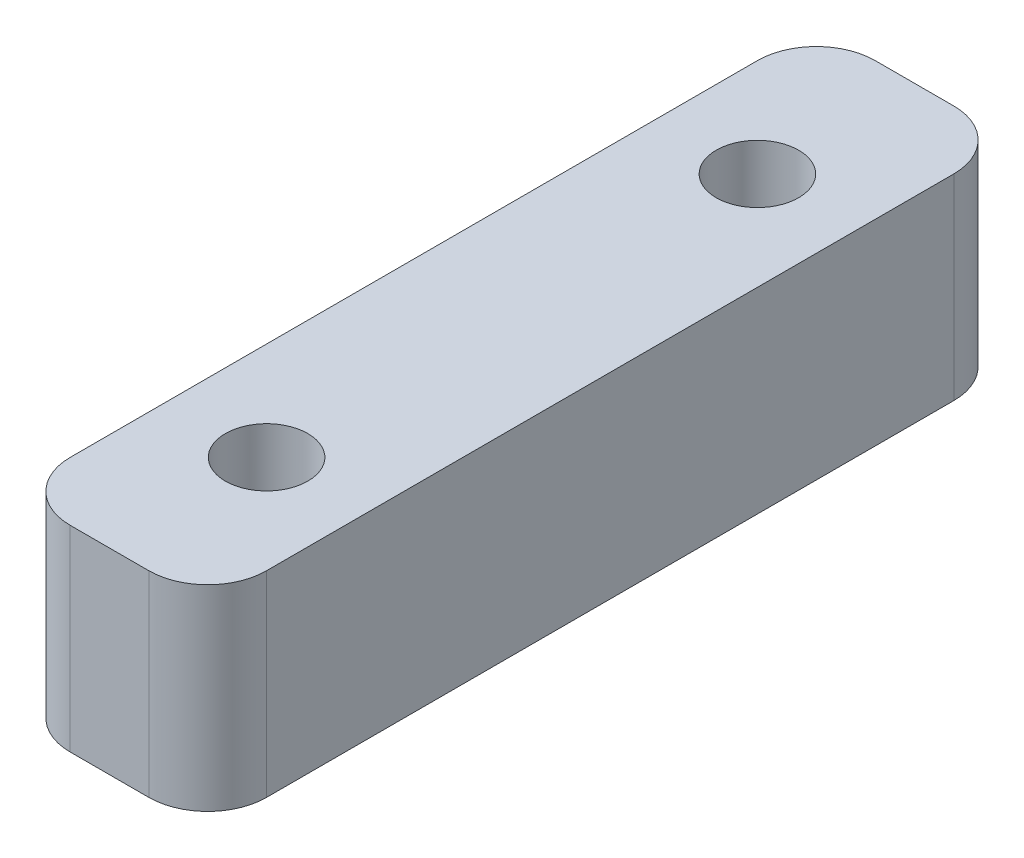
ISO-10303-21;
HEADER;
FILE_DESCRIPTION(('STEP AP214'),'2;1');
FILE_NAME('part.step','',(''),(''),'','','');
FILE_SCHEMA(('AUTOMOTIVE_DESIGN { 1 0 10303 214 1 1 1 1 }'));
ENDSEC;
DATA;
#1=APPLICATION_CONTEXT('core data for automotive mechanical design processes');
#2=APPLICATION_PROTOCOL_DEFINITION('international standard','automotive_design',2000,#1);
#3=PRODUCT_CONTEXT('',#1,'mechanical');
#4=PRODUCT('Part','Part','',(#3));
#5=PRODUCT_RELATED_PRODUCT_CATEGORY('part','',(#4));
#6=PRODUCT_DEFINITION_FORMATION('','',#4);
#7=PRODUCT_DEFINITION_CONTEXT('part definition',#1,'design');
#8=PRODUCT_DEFINITION('design','',#6,#7);
#9=PRODUCT_DEFINITION_SHAPE('','',#8);
#10=(LENGTH_UNIT() NAMED_UNIT(*) SI_UNIT(.MILLI.,.METRE.));
#11=(NAMED_UNIT(*) PLANE_ANGLE_UNIT() SI_UNIT($,.RADIAN.));
#12=(NAMED_UNIT(*) SI_UNIT($,.STERADIAN.) SOLID_ANGLE_UNIT());
#13=UNCERTAINTY_MEASURE_WITH_UNIT(LENGTH_MEASURE(1.E-05),#10,'distance_accuracy_value','');
#14=(GEOMETRIC_REPRESENTATION_CONTEXT(3) GLOBAL_UNCERTAINTY_ASSIGNED_CONTEXT((#13)) GLOBAL_UNIT_ASSIGNED_CONTEXT((#10,
#11,#12)) REPRESENTATION_CONTEXT('',''));
#15=CARTESIAN_POINT('',(0.,0.,0.));
#16=DIRECTION('',(0.,0.,1.));
#17=DIRECTION('',(1.,0.,0.));
#18=AXIS2_PLACEMENT_3D('',#15,#16,#17);
#19=CARTESIAN_POINT('',(0.,10.,0.));
#20=DIRECTION('',(0.,1.,0.));
#21=DIRECTION('',(0.,0.,1.));
#22=AXIS2_PLACEMENT_3D('',#19,#20,#21);
#23=PLANE('',#22);
#24=CARTESIAN_POINT('',(-47.5,10.,90.));
#25=DIRECTION('',(0.,1.,0.));
#26=DIRECTION('',(0.,0.,-1.));
#27=AXIS2_PLACEMENT_3D('',#24,#25,#26);
#28=CIRCLE('',#27,2.10000000000001);
#29=CARTESIAN_POINT('',(-47.5,10.,87.9));
#30=VERTEX_POINT('',#29);
#31=EDGE_CURVE('E157',#30,#30,#28,.T.);
#32=ORIENTED_EDGE('',*,*,#31,.F.);
#33=EDGE_LOOP('',(#32));
#34=FACE_BOUND('',#33,.T.);
#35=CARTESIAN_POINT('',(-47.5,10.,65.));
#36=DIRECTION('',(0.,1.,0.));
#37=DIRECTION('',(0.,0.,1.));
#38=AXIS2_PLACEMENT_3D('',#35,#36,#37);
#39=CIRCLE('',#38,2.1);
#40=CARTESIAN_POINT('',(-47.5,10.,67.1));
#41=VERTEX_POINT('',#40);
#42=EDGE_CURVE('E160',#41,#41,#39,.T.);
#43=ORIENTED_EDGE('',*,*,#42,.F.);
#44=EDGE_LOOP('',(#43));
#45=FACE_BOUND('',#44,.T.);
#46=DIRECTION('',(1.,0.,0.));
#47=VECTOR('',#46,1.);
#48=CARTESIAN_POINT('',(-67.5,10.,98.));
#49=LINE('',#48,#47);
#50=CARTESIAN_POINT('',(-49.5,10.,98.));
#51=VERTEX_POINT('',#50);
#52=CARTESIAN_POINT('',(-45.5,10.,98.));
#53=VERTEX_POINT('',#52);
#54=EDGE_CURVE('E103',#51,#53,#49,.T.);
#55=ORIENTED_EDGE('',*,*,#54,.T.);
#56=CARTESIAN_POINT('',(-45.5,10.,95.));
#57=DIRECTION('',(0.,1.,0.));
#58=DIRECTION('',(0.,0.,1.));
#59=AXIS2_PLACEMENT_3D('',#56,#57,#58);
#60=CIRCLE('',#59,3.);
#61=CARTESIAN_POINT('',(-42.5,10.,95.));
#62=VERTEX_POINT('',#61);
#63=EDGE_CURVE('E136',#53,#62,#60,.T.);
#64=ORIENTED_EDGE('',*,*,#63,.T.);
#65=DIRECTION('',(0.,0.,-1.));
#66=VECTOR('',#65,1.);
#67=CARTESIAN_POINT('',(-42.5,10.,97.9999999999999));
#68=LINE('',#67,#66);
#69=CARTESIAN_POINT('',(-42.5,10.,60.));
#70=VERTEX_POINT('',#69);
#71=EDGE_CURVE('E165',#62,#70,#68,.T.);
#72=ORIENTED_EDGE('',*,*,#71,.T.);
#73=CARTESIAN_POINT('',(-45.5,10.,60.));
#74=DIRECTION('',(0.,1.,0.));
#75=DIRECTION('',(0.,0.,1.));
#76=AXIS2_PLACEMENT_3D('',#73,#74,#75);
#77=CIRCLE('',#76,3.);
#78=CARTESIAN_POINT('',(-45.5,10.,57.));
#79=VERTEX_POINT('',#78);
#80=EDGE_CURVE('E134',#70,#79,#77,.T.);
#81=ORIENTED_EDGE('',*,*,#80,.T.);
#82=DIRECTION('',(-1.,0.,0.));
#83=VECTOR('',#82,1.);
#84=CARTESIAN_POINT('',(-67.5,10.,57.));
#85=LINE('',#84,#83);
#86=CARTESIAN_POINT('',(-49.5,10.,57.));
#87=VERTEX_POINT('',#86);
#88=EDGE_CURVE('E121',#79,#87,#85,.T.);
#89=ORIENTED_EDGE('',*,*,#88,.T.);
#90=CARTESIAN_POINT('',(-49.5,10.,60.));
#91=DIRECTION('',(0.,1.,0.));
#92=DIRECTION('',(0.,0.,1.));
#93=AXIS2_PLACEMENT_3D('',#90,#91,#92);
#94=CIRCLE('',#93,3.);
#95=CARTESIAN_POINT('',(-52.5,10.,60.));
#96=VERTEX_POINT('',#95);
#97=EDGE_CURVE('E110',#87,#96,#94,.T.);
#98=ORIENTED_EDGE('',*,*,#97,.T.);
#99=DIRECTION('',(0.,0.,-1.));
#100=VECTOR('',#99,1.);
#101=CARTESIAN_POINT('',(-52.5,10.,57.));
#102=LINE('',#101,#100);
#103=CARTESIAN_POINT('',(-52.5,10.,95.));
#104=VERTEX_POINT('',#103);
#105=EDGE_CURVE('E105',#104,#96,#102,.T.);
#106=ORIENTED_EDGE('',*,*,#105,.F.);
#107=CARTESIAN_POINT('',(-49.5,10.,95.));
#108=DIRECTION('',(0.,1.,0.));
#109=DIRECTION('',(0.,0.,1.));
#110=AXIS2_PLACEMENT_3D('',#107,#108,#109);
#111=CIRCLE('',#110,3.);
#112=EDGE_CURVE('E101',#104,#51,#111,.T.);
#113=ORIENTED_EDGE('',*,*,#112,.T.);
#114=EDGE_LOOP('',(#55,#64,#72,#81,#89,#98,#106,#113));
#115=FACE_BOUND('',#114,.T.);
#116=ADVANCED_FACE('F35',(#34,#45,#115),#23,.T.);
#117=CARTESIAN_POINT('',(0.,0.,0.));
#118=DIRECTION('',(0.,1.,0.));
#119=DIRECTION('',(0.,0.,1.));
#120=AXIS2_PLACEMENT_3D('',#117,#118,#119);
#121=PLANE('',#120);
#122=CARTESIAN_POINT('',(-47.5,0.,90.));
#123=DIRECTION('',(0.,1.,0.));
#124=DIRECTION('',(0.,0.,1.));
#125=AXIS2_PLACEMENT_3D('',#122,#123,#124);
#126=CIRCLE('',#125,2.10000000000001);
#127=CARTESIAN_POINT('',(-47.5,0.,92.1));
#128=VERTEX_POINT('',#127);
#129=EDGE_CURVE('E129',#128,#128,#126,.F.);
#130=ORIENTED_EDGE('',*,*,#129,.F.);
#131=EDGE_LOOP('',(#130));
#132=FACE_BOUND('',#131,.T.);
#133=CARTESIAN_POINT('',(-47.5,0.,65.));
#134=DIRECTION('',(0.,1.,0.));
#135=DIRECTION('',(0.,0.,1.));
#136=AXIS2_PLACEMENT_3D('',#133,#134,#135);
#137=CIRCLE('',#136,2.1);
#138=CARTESIAN_POINT('',(-47.5,0.,67.1));
#139=VERTEX_POINT('',#138);
#140=EDGE_CURVE('E125',#139,#139,#137,.F.);
#141=ORIENTED_EDGE('',*,*,#140,.F.);
#142=EDGE_LOOP('',(#141));
#143=FACE_BOUND('',#142,.T.);
#144=DIRECTION('',(0.,0.,-1.));
#145=VECTOR('',#144,1.);
#146=CARTESIAN_POINT('',(-42.5,0.,97.9999999999999));
#147=LINE('',#146,#145);
#148=CARTESIAN_POINT('',(-42.5,0.,95.));
#149=VERTEX_POINT('',#148);
#150=CARTESIAN_POINT('',(-42.5,0.,60.));
#151=VERTEX_POINT('',#150);
#152=EDGE_CURVE('E162',#149,#151,#147,.T.);
#153=ORIENTED_EDGE('',*,*,#152,.F.);
#154=CARTESIAN_POINT('',(-45.5,0.,95.));
#155=DIRECTION('',(0.,1.,0.));
#156=DIRECTION('',(0.,0.,1.));
#157=AXIS2_PLACEMENT_3D('',#154,#155,#156);
#158=CIRCLE('',#157,3.);
#159=CARTESIAN_POINT('',(-45.5,0.,98.));
#160=VERTEX_POINT('',#159);
#161=EDGE_CURVE('E147',#149,#160,#158,.F.);
#162=ORIENTED_EDGE('',*,*,#161,.T.);
#163=DIRECTION('',(-1.,0.,0.));
#164=VECTOR('',#163,1.);
#165=CARTESIAN_POINT('',(-67.5,0.,98.));
#166=LINE('',#165,#164);
#167=CARTESIAN_POINT('',(-49.5,0.,98.));
#168=VERTEX_POINT('',#167);
#169=EDGE_CURVE('E169',#160,#168,#166,.T.);
#170=ORIENTED_EDGE('',*,*,#169,.T.);
#171=CARTESIAN_POINT('',(-49.5,0.,95.));
#172=DIRECTION('',(0.,1.,0.));
#173=DIRECTION('',(0.,0.,1.));
#174=AXIS2_PLACEMENT_3D('',#171,#172,#173);
#175=CIRCLE('',#174,3.);
#176=CARTESIAN_POINT('',(-52.5,0.,95.));
#177=VERTEX_POINT('',#176);
#178=EDGE_CURVE('E124',#168,#177,#175,.F.);
#179=ORIENTED_EDGE('',*,*,#178,.T.);
#180=DIRECTION('',(0.,0.,-1.));
#181=VECTOR('',#180,1.);
#182=CARTESIAN_POINT('',(-52.5,0.,57.));
#183=LINE('',#182,#181);
#184=CARTESIAN_POINT('',(-52.5,0.,60.));
#185=VERTEX_POINT('',#184);
#186=EDGE_CURVE('E156',#177,#185,#183,.T.);
#187=ORIENTED_EDGE('',*,*,#186,.T.);
#188=CARTESIAN_POINT('',(-49.5,0.,60.));
#189=DIRECTION('',(0.,1.,0.));
#190=DIRECTION('',(0.,0.,1.));
#191=AXIS2_PLACEMENT_3D('',#188,#189,#190);
#192=CIRCLE('',#191,3.);
#193=CARTESIAN_POINT('',(-49.5,0.,57.));
#194=VERTEX_POINT('',#193);
#195=EDGE_CURVE('E57',#185,#194,#192,.F.);
#196=ORIENTED_EDGE('',*,*,#195,.T.);
#197=DIRECTION('',(1.,0.,0.));
#198=VECTOR('',#197,1.);
#199=CARTESIAN_POINT('',(-67.5,0.,57.));
#200=LINE('',#199,#198);
#201=CARTESIAN_POINT('',(-45.5,0.,57.));
#202=VERTEX_POINT('',#201);
#203=EDGE_CURVE('E120',#194,#202,#200,.T.);
#204=ORIENTED_EDGE('',*,*,#203,.T.);
#205=CARTESIAN_POINT('',(-45.5,0.,60.));
#206=DIRECTION('',(0.,1.,0.));
#207=DIRECTION('',(0.,0.,1.));
#208=AXIS2_PLACEMENT_3D('',#205,#206,#207);
#209=CIRCLE('',#208,3.);
#210=EDGE_CURVE('E145',#202,#151,#209,.F.);
#211=ORIENTED_EDGE('',*,*,#210,.T.);
#212=EDGE_LOOP('',(#153,#162,#170,#179,#187,#196,#204,#211));
#213=FACE_BOUND('',#212,.T.);
#214=ADVANCED_FACE('F184',(#132,#143,#213),#121,.F.);
#215=CARTESIAN_POINT('',(-67.5,-155.913437522235,57.));
#216=DIRECTION('',(0.,0.,-1.));
#217=DIRECTION('',(-1.,0.,0.));
#218=AXIS2_PLACEMENT_3D('',#215,#216,#217);
#219=PLANE('',#218);
#220=ORIENTED_EDGE('',*,*,#88,.F.);
#221=DIRECTION('',(0.,1.,0.));
#222=VECTOR('',#221,1.);
#223=CARTESIAN_POINT('',(-45.5,-155.913437522235,57.));
#224=LINE('',#223,#222);
#225=EDGE_CURVE('E50',#79,#202,#224,.F.);
#226=ORIENTED_EDGE('',*,*,#225,.T.);
#227=ORIENTED_EDGE('',*,*,#203,.F.);
#228=DIRECTION('',(0.,1.,0.));
#229=VECTOR('',#228,1.);
#230=CARTESIAN_POINT('',(-49.5,10.,57.));
#231=LINE('',#230,#229);
#232=EDGE_CURVE('E149',#194,#87,#231,.T.);
#233=ORIENTED_EDGE('',*,*,#232,.T.);
#234=EDGE_LOOP('',(#220,#226,#227,#233));
#235=FACE_BOUND('',#234,.T.);
#236=ADVANCED_FACE('F176',(#235),#219,.T.);
#237=CARTESIAN_POINT('',(-67.5,-155.913437522235,98.));
#238=DIRECTION('',(0.,0.,1.));
#239=DIRECTION('',(1.,0.,0.));
#240=AXIS2_PLACEMENT_3D('',#237,#238,#239);
#241=PLANE('',#240);
#242=ORIENTED_EDGE('',*,*,#169,.F.);
#243=DIRECTION('',(0.,1.,0.));
#244=VECTOR('',#243,1.);
#245=CARTESIAN_POINT('',(-45.5,-155.913437522235,98.));
#246=LINE('',#245,#244);
#247=EDGE_CURVE('E111',#160,#53,#246,.T.);
#248=ORIENTED_EDGE('',*,*,#247,.T.);
#249=ORIENTED_EDGE('',*,*,#54,.F.);
#250=DIRECTION('',(0.,1.,0.));
#251=VECTOR('',#250,1.);
#252=CARTESIAN_POINT('',(-49.5,0.,98.));
#253=LINE('',#252,#251);
#254=EDGE_CURVE('E117',#51,#168,#253,.F.);
#255=ORIENTED_EDGE('',*,*,#254,.T.);
#256=EDGE_LOOP('',(#242,#248,#249,#255));
#257=FACE_BOUND('',#256,.T.);
#258=ADVANCED_FACE('F116',(#257),#241,.T.);
#259=CARTESIAN_POINT('',(-47.5,-155.913437522235,65.));
#260=DIRECTION('',(0.,1.,0.));
#261=DIRECTION('',(0.,0.,1.));
#262=AXIS2_PLACEMENT_3D('',#259,#260,#261);
#263=CYLINDRICAL_SURFACE('',#262,2.1);
#264=ORIENTED_EDGE('',*,*,#140,.T.);
#265=EDGE_LOOP('',(#264));
#266=FACE_BOUND('',#265,.T.);
#267=ORIENTED_EDGE('',*,*,#42,.T.);
#268=EDGE_LOOP('',(#267));
#269=FACE_BOUND('',#268,.T.);
#270=ADVANCED_FACE('F216',(#266,#269),#263,.F.);
#271=CARTESIAN_POINT('',(-47.5,-155.913437522235,90.));
#272=DIRECTION('',(0.,1.,0.));
#273=DIRECTION('',(0.,0.,1.));
#274=AXIS2_PLACEMENT_3D('',#271,#272,#273);
#275=CYLINDRICAL_SURFACE('',#274,2.10000000000001);
#276=ORIENTED_EDGE('',*,*,#129,.T.);
#277=EDGE_LOOP('',(#276));
#278=FACE_BOUND('',#277,.T.);
#279=ORIENTED_EDGE('',*,*,#31,.T.);
#280=EDGE_LOOP('',(#279));
#281=FACE_BOUND('',#280,.T.);
#282=ADVANCED_FACE('F219',(#278,#281),#275,.F.);
#283=CARTESIAN_POINT('',(-52.5,0.,57.));
#284=DIRECTION('',(1.,0.,0.));
#285=DIRECTION('',(0.,0.,-1.));
#286=AXIS2_PLACEMENT_3D('',#283,#284,#285);
#287=PLANE('',#286);
#288=ORIENTED_EDGE('',*,*,#105,.T.);
#289=DIRECTION('',(0.,1.,0.));
#290=VECTOR('',#289,1.);
#291=CARTESIAN_POINT('',(-52.5,0.,60.));
#292=LINE('',#291,#290);
#293=EDGE_CURVE('E12',#96,#185,#292,.F.);
#294=ORIENTED_EDGE('',*,*,#293,.T.);
#295=ORIENTED_EDGE('',*,*,#186,.F.);
#296=DIRECTION('',(0.,1.,0.));
#297=VECTOR('',#296,1.);
#298=CARTESIAN_POINT('',(-52.5,10.,95.));
#299=LINE('',#298,#297);
#300=EDGE_CURVE('E43',#177,#104,#299,.T.);
#301=ORIENTED_EDGE('',*,*,#300,.T.);
#302=EDGE_LOOP('',(#288,#294,#295,#301));
#303=FACE_BOUND('',#302,.T.);
#304=ADVANCED_FACE('F154',(#303),#287,.F.);
#305=CARTESIAN_POINT('',(-42.5,0.,97.9999999999999));
#306=DIRECTION('',(1.,0.,0.));
#307=DIRECTION('',(0.,0.,-1.));
#308=AXIS2_PLACEMENT_3D('',#305,#306,#307);
#309=PLANE('',#308);
#310=ORIENTED_EDGE('',*,*,#71,.F.);
#311=DIRECTION('',(0.,1.,0.));
#312=VECTOR('',#311,1.);
#313=CARTESIAN_POINT('',(-42.5,0.,95.));
#314=LINE('',#313,#312);
#315=EDGE_CURVE('E141',#62,#149,#314,.F.);
#316=ORIENTED_EDGE('',*,*,#315,.T.);
#317=ORIENTED_EDGE('',*,*,#152,.T.);
#318=DIRECTION('',(0.,1.,0.));
#319=VECTOR('',#318,1.);
#320=CARTESIAN_POINT('',(-42.5,0.,60.));
#321=LINE('',#320,#319);
#322=EDGE_CURVE('E138',#151,#70,#321,.T.);
#323=ORIENTED_EDGE('',*,*,#322,.T.);
#324=EDGE_LOOP('',(#310,#316,#317,#323));
#325=FACE_BOUND('',#324,.T.);
#326=ADVANCED_FACE('F188',(#325),#309,.T.);
#327=CARTESIAN_POINT('',(-45.5,-155.913437522235,95.));
#328=DIRECTION('',(0.,1.,0.));
#329=DIRECTION('',(0.,0.,1.));
#330=AXIS2_PLACEMENT_3D('',#327,#328,#329);
#331=CYLINDRICAL_SURFACE('',#330,3.);
#332=ORIENTED_EDGE('',*,*,#161,.F.);
#333=ORIENTED_EDGE('',*,*,#315,.F.);
#334=ORIENTED_EDGE('',*,*,#63,.F.);
#335=ORIENTED_EDGE('',*,*,#247,.F.);
#336=EDGE_LOOP('',(#332,#333,#334,#335));
#337=FACE_BOUND('',#336,.T.);
#338=ADVANCED_FACE('F191',(#337),#331,.T.);
#339=CARTESIAN_POINT('',(-45.5,0.,60.));
#340=DIRECTION('',(0.,1.,0.));
#341=DIRECTION('',(0.,0.,1.));
#342=AXIS2_PLACEMENT_3D('',#339,#340,#341);
#343=CYLINDRICAL_SURFACE('',#342,3.);
#344=ORIENTED_EDGE('',*,*,#210,.F.);
#345=ORIENTED_EDGE('',*,*,#225,.F.);
#346=ORIENTED_EDGE('',*,*,#80,.F.);
#347=ORIENTED_EDGE('',*,*,#322,.F.);
#348=EDGE_LOOP('',(#344,#345,#346,#347));
#349=FACE_BOUND('',#348,.T.);
#350=ADVANCED_FACE('F180',(#349),#343,.T.);
#351=CARTESIAN_POINT('',(-49.5,-155.913437522235,60.));
#352=DIRECTION('',(0.,-1.,0.));
#353=DIRECTION('',(0.,0.,-1.));
#354=AXIS2_PLACEMENT_3D('',#351,#352,#353);
#355=CYLINDRICAL_SURFACE('',#354,3.);
#356=ORIENTED_EDGE('',*,*,#195,.F.);
#357=ORIENTED_EDGE('',*,*,#293,.F.);
#358=ORIENTED_EDGE('',*,*,#97,.F.);
#359=ORIENTED_EDGE('',*,*,#232,.F.);
#360=EDGE_LOOP('',(#356,#357,#358,#359));
#361=FACE_BOUND('',#360,.T.);
#362=ADVANCED_FACE('F198',(#361),#355,.T.);
#363=CARTESIAN_POINT('',(-49.5,0.,95.));
#364=DIRECTION('',(0.,-1.,0.));
#365=DIRECTION('',(0.,0.,-1.));
#366=AXIS2_PLACEMENT_3D('',#363,#364,#365);
#367=CYLINDRICAL_SURFACE('',#366,3.);
#368=ORIENTED_EDGE('',*,*,#178,.F.);
#369=ORIENTED_EDGE('',*,*,#254,.F.);
#370=ORIENTED_EDGE('',*,*,#112,.F.);
#371=ORIENTED_EDGE('',*,*,#300,.F.);
#372=EDGE_LOOP('',(#368,#369,#370,#371));
#373=FACE_BOUND('',#372,.T.);
#374=ADVANCED_FACE('F37',(#373),#367,.T.);
#375=CLOSED_SHELL('',(#116,#214,#236,#258,#270,#282,#304,#326,#338,#350,#362,#374));
#376=MANIFOLD_SOLID_BREP('B2',#375);
#377=ADVANCED_BREP_SHAPE_REPRESENTATION('',(#18,#376),#14);
#378=SHAPE_DEFINITION_REPRESENTATION(#9,#377);
ENDSEC;
END-ISO-10303-21;
